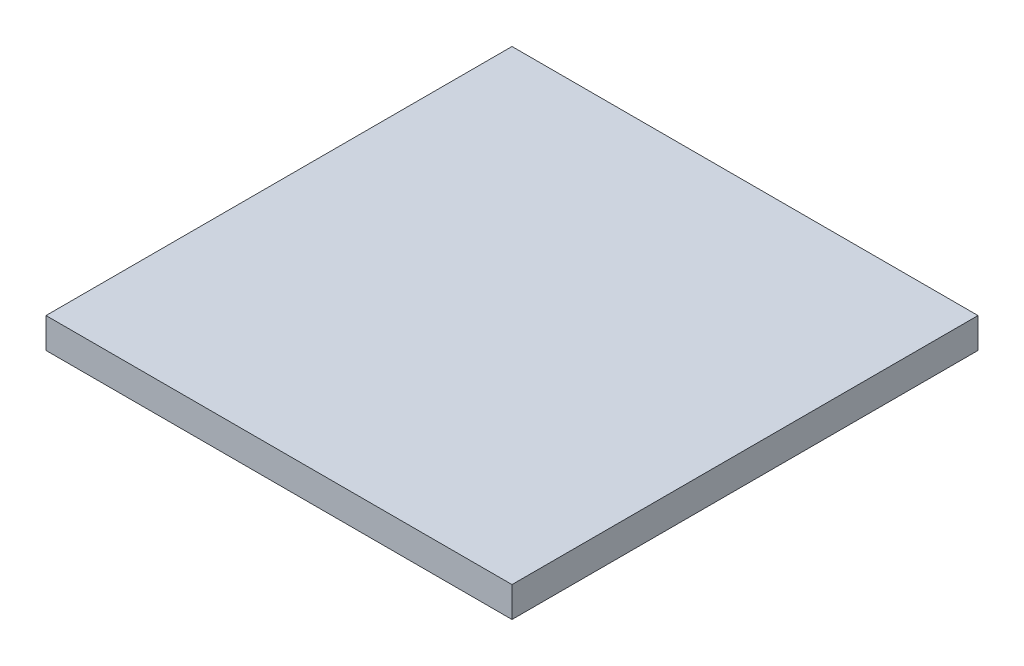
ISO-10303-21;
HEADER;
FILE_DESCRIPTION(('STEP AP214'),'2;1');
FILE_NAME('part.step','',(''),(''),'','','');
FILE_SCHEMA(('AUTOMOTIVE_DESIGN { 1 0 10303 214 1 1 1 1 }'));
ENDSEC;
DATA;
#1=APPLICATION_CONTEXT('core data for automotive mechanical design processes');
#2=APPLICATION_PROTOCOL_DEFINITION('international standard','automotive_design',2000,#1);
#3=PRODUCT_CONTEXT('',#1,'mechanical');
#4=PRODUCT('Part','Part','',(#3));
#5=PRODUCT_RELATED_PRODUCT_CATEGORY('part','',(#4));
#6=PRODUCT_DEFINITION_FORMATION('','',#4);
#7=PRODUCT_DEFINITION_CONTEXT('part definition',#1,'design');
#8=PRODUCT_DEFINITION('design','',#6,#7);
#9=PRODUCT_DEFINITION_SHAPE('','',#8);
#10=(LENGTH_UNIT() NAMED_UNIT(*) SI_UNIT(.MILLI.,.METRE.));
#11=(NAMED_UNIT(*) PLANE_ANGLE_UNIT() SI_UNIT($,.RADIAN.));
#12=(NAMED_UNIT(*) SI_UNIT($,.STERADIAN.) SOLID_ANGLE_UNIT());
#13=UNCERTAINTY_MEASURE_WITH_UNIT(LENGTH_MEASURE(1.E-05),#10,'distance_accuracy_value','');
#14=(GEOMETRIC_REPRESENTATION_CONTEXT(3) GLOBAL_UNCERTAINTY_ASSIGNED_CONTEXT((#13)) GLOBAL_UNIT_ASSIGNED_CONTEXT((#10,
#11,#12)) REPRESENTATION_CONTEXT('',''));
#15=CARTESIAN_POINT('',(0.,0.,0.));
#16=DIRECTION('',(0.,0.,1.));
#17=DIRECTION('',(1.,0.,0.));
#18=AXIS2_PLACEMENT_3D('',#15,#16,#17);
#19=CARTESIAN_POINT('',(2925.,380.,-2925.));
#20=DIRECTION('',(-1.,0.,0.));
#21=DIRECTION('',(0.,0.,1.));
#22=AXIS2_PLACEMENT_3D('',#19,#20,#21);
#23=PLANE('',#22);
#24=DIRECTION('',(0.,0.,-1.));
#25=VECTOR('',#24,1.);
#26=CARTESIAN_POINT('',(2925.,0.,-2925.));
#27=LINE('',#26,#25);
#28=CARTESIAN_POINT('',(2925.,0.,2925.));
#29=VERTEX_POINT('',#28);
#30=CARTESIAN_POINT('',(2925.,0.,-2925.));
#31=VERTEX_POINT('',#30);
#32=EDGE_CURVE('E99',#29,#31,#27,.T.);
#33=ORIENTED_EDGE('',*,*,#32,.T.);
#34=DIRECTION('',(0.,-1.,0.));
#35=VECTOR('',#34,1.);
#36=CARTESIAN_POINT('',(2925.,380.,-2925.));
#37=LINE('',#36,#35);
#38=CARTESIAN_POINT('',(2925.,380.,-2925.));
#39=VERTEX_POINT('',#38);
#40=EDGE_CURVE('E11',#39,#31,#37,.T.);
#41=ORIENTED_EDGE('',*,*,#40,.F.);
#42=DIRECTION('',(0.,0.,-1.));
#43=VECTOR('',#42,1.);
#44=CARTESIAN_POINT('',(2925.,380.,-2925.));
#45=LINE('',#44,#43);
#46=CARTESIAN_POINT('',(2925.,380.,2925.));
#47=VERTEX_POINT('',#46);
#48=EDGE_CURVE('E87',#47,#39,#45,.T.);
#49=ORIENTED_EDGE('',*,*,#48,.F.);
#50=DIRECTION('',(0.,-1.,0.));
#51=VECTOR('',#50,1.);
#52=CARTESIAN_POINT('',(2925.,380.,2925.));
#53=LINE('',#52,#51);
#54=EDGE_CURVE('E95',#47,#29,#53,.T.);
#55=ORIENTED_EDGE('',*,*,#54,.T.);
#56=EDGE_LOOP('',(#33,#41,#49,#55));
#57=FACE_BOUND('',#56,.T.);
#58=ADVANCED_FACE('F36',(#57),#23,.F.);
#59=CARTESIAN_POINT('',(-2925.,380.,-2925.));
#60=DIRECTION('',(0.,0.,1.));
#61=DIRECTION('',(1.,0.,0.));
#62=AXIS2_PLACEMENT_3D('',#59,#60,#61);
#63=PLANE('',#62);
#64=DIRECTION('',(-1.,0.,0.));
#65=VECTOR('',#64,1.);
#66=CARTESIAN_POINT('',(-2925.,0.,-2925.));
#67=LINE('',#66,#65);
#68=CARTESIAN_POINT('',(-2925.,0.,-2925.));
#69=VERTEX_POINT('',#68);
#70=EDGE_CURVE('E91',#31,#69,#67,.T.);
#71=ORIENTED_EDGE('',*,*,#70,.T.);
#72=DIRECTION('',(0.,-1.,0.));
#73=VECTOR('',#72,1.);
#74=CARTESIAN_POINT('',(-2925.,380.,-2925.));
#75=LINE('',#74,#73);
#76=CARTESIAN_POINT('',(-2925.,380.,-2925.));
#77=VERTEX_POINT('',#76);
#78=EDGE_CURVE('E44',#77,#69,#75,.T.);
#79=ORIENTED_EDGE('',*,*,#78,.F.);
#80=DIRECTION('',(-1.,0.,0.));
#81=VECTOR('',#80,1.);
#82=CARTESIAN_POINT('',(-2925.,380.,-2925.));
#83=LINE('',#82,#81);
#84=EDGE_CURVE('E82',#39,#77,#83,.T.);
#85=ORIENTED_EDGE('',*,*,#84,.F.);
#86=ORIENTED_EDGE('',*,*,#40,.T.);
#87=EDGE_LOOP('',(#71,#79,#85,#86));
#88=FACE_BOUND('',#87,.T.);
#89=ADVANCED_FACE('F90',(#88),#63,.F.);
#90=CARTESIAN_POINT('',(-2925.,380.,-2925.));
#91=DIRECTION('',(1.,0.,0.));
#92=DIRECTION('',(0.,0.,-1.));
#93=AXIS2_PLACEMENT_3D('',#90,#91,#92);
#94=PLANE('',#93);
#95=DIRECTION('',(0.,0.,1.));
#96=VECTOR('',#95,1.);
#97=CARTESIAN_POINT('',(-2925.,0.,-2925.));
#98=LINE('',#97,#96);
#99=CARTESIAN_POINT('',(-2925.,0.,2925.));
#100=VERTEX_POINT('',#99);
#101=EDGE_CURVE('E69',#69,#100,#98,.T.);
#102=ORIENTED_EDGE('',*,*,#101,.T.);
#103=DIRECTION('',(0.,-1.,0.));
#104=VECTOR('',#103,1.);
#105=CARTESIAN_POINT('',(-2925.,380.,2925.));
#106=LINE('',#105,#104);
#107=CARTESIAN_POINT('',(-2925.,380.,2925.));
#108=VERTEX_POINT('',#107);
#109=EDGE_CURVE('E92',#108,#100,#106,.T.);
#110=ORIENTED_EDGE('',*,*,#109,.F.);
#111=DIRECTION('',(0.,0.,1.));
#112=VECTOR('',#111,1.);
#113=CARTESIAN_POINT('',(-2925.,380.,-2925.));
#114=LINE('',#113,#112);
#115=EDGE_CURVE('E85',#77,#108,#114,.T.);
#116=ORIENTED_EDGE('',*,*,#115,.F.);
#117=ORIENTED_EDGE('',*,*,#78,.T.);
#118=EDGE_LOOP('',(#102,#110,#116,#117));
#119=FACE_BOUND('',#118,.T.);
#120=ADVANCED_FACE('F93',(#119),#94,.F.);
#121=CARTESIAN_POINT('',(-2925.,380.,2925.));
#122=DIRECTION('',(0.,0.,-1.));
#123=DIRECTION('',(-1.,0.,0.));
#124=AXIS2_PLACEMENT_3D('',#121,#122,#123);
#125=PLANE('',#124);
#126=DIRECTION('',(1.,0.,0.));
#127=VECTOR('',#126,1.);
#128=CARTESIAN_POINT('',(-2925.,0.,2925.));
#129=LINE('',#128,#127);
#130=EDGE_CURVE('E75',#100,#29,#129,.T.);
#131=ORIENTED_EDGE('',*,*,#130,.T.);
#132=ORIENTED_EDGE('',*,*,#54,.F.);
#133=DIRECTION('',(1.,0.,0.));
#134=VECTOR('',#133,1.);
#135=CARTESIAN_POINT('',(-2925.,380.,2925.));
#136=LINE('',#135,#134);
#137=EDGE_CURVE('E52',#108,#47,#136,.T.);
#138=ORIENTED_EDGE('',*,*,#137,.F.);
#139=ORIENTED_EDGE('',*,*,#109,.T.);
#140=EDGE_LOOP('',(#131,#132,#138,#139));
#141=FACE_BOUND('',#140,.T.);
#142=ADVANCED_FACE('F106',(#141),#125,.F.);
#143=CARTESIAN_POINT('',(0.,380.,0.));
#144=DIRECTION('',(0.,1.,0.));
#145=DIRECTION('',(0.,0.,1.));
#146=AXIS2_PLACEMENT_3D('',#143,#144,#145);
#147=PLANE('',#146);
#148=ORIENTED_EDGE('',*,*,#48,.T.);
#149=ORIENTED_EDGE('',*,*,#84,.T.);
#150=ORIENTED_EDGE('',*,*,#115,.T.);
#151=ORIENTED_EDGE('',*,*,#137,.T.);
#152=EDGE_LOOP('',(#148,#149,#150,#151));
#153=FACE_BOUND('',#152,.T.);
#154=ADVANCED_FACE('F83',(#153),#147,.T.);
#155=CARTESIAN_POINT('',(0.,0.,0.));
#156=DIRECTION('',(0.,1.,0.));
#157=DIRECTION('',(0.,0.,1.));
#158=AXIS2_PLACEMENT_3D('',#155,#156,#157);
#159=PLANE('',#158);
#160=ORIENTED_EDGE('',*,*,#32,.F.);
#161=ORIENTED_EDGE('',*,*,#130,.F.);
#162=ORIENTED_EDGE('',*,*,#101,.F.);
#163=ORIENTED_EDGE('',*,*,#70,.F.);
#164=EDGE_LOOP('',(#160,#161,#162,#163));
#165=FACE_BOUND('',#164,.T.);
#166=ADVANCED_FACE('F109',(#165),#159,.F.);
#167=CLOSED_SHELL('',(#58,#89,#120,#142,#154,#166));
#168=MANIFOLD_SOLID_BREP('B2',#167);
#169=ADVANCED_BREP_SHAPE_REPRESENTATION('',(#18,#168),#14);
#170=SHAPE_DEFINITION_REPRESENTATION(#9,#169);
ENDSEC;
END-ISO-10303-21;
